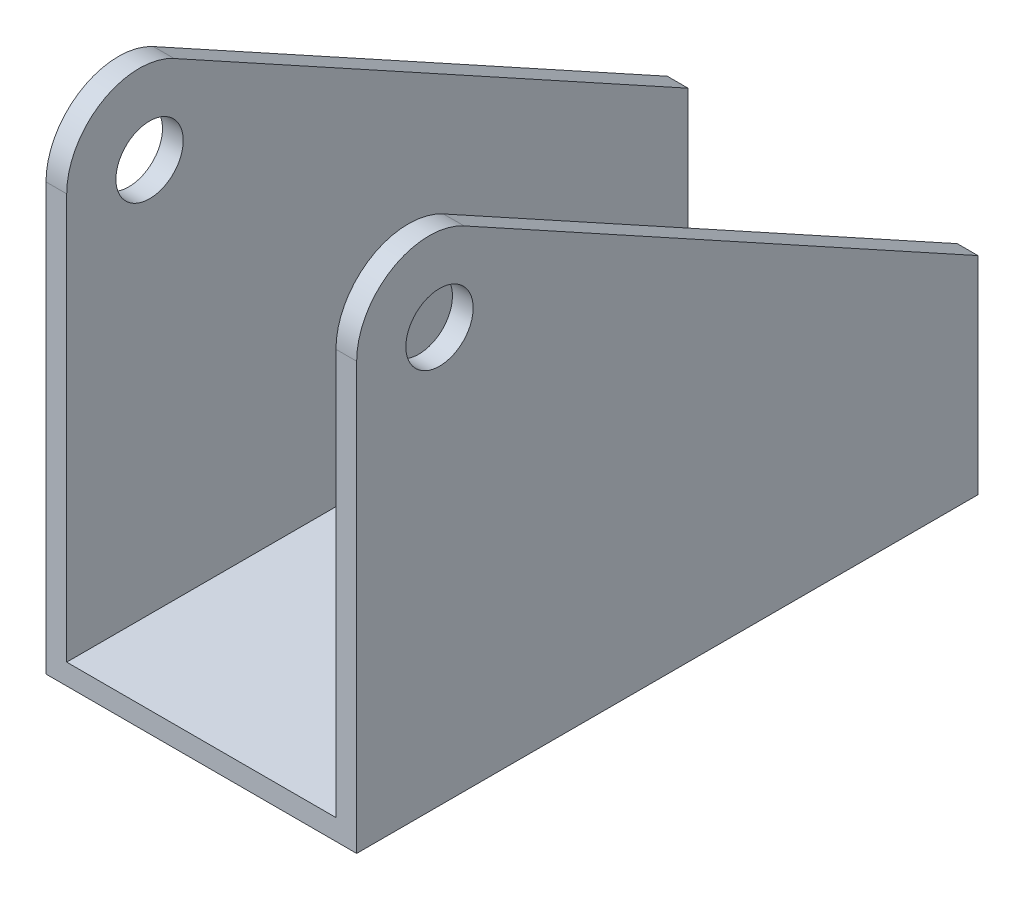
ISO-10303-21;
HEADER;
FILE_DESCRIPTION(('STEP AP214'),'2;1');
FILE_NAME('part.step','',(''),(''),'','','');
FILE_SCHEMA(('AUTOMOTIVE_DESIGN { 1 0 10303 214 1 1 1 1 }'));
ENDSEC;
DATA;
#1=APPLICATION_CONTEXT('core data for automotive mechanical design processes');
#2=APPLICATION_PROTOCOL_DEFINITION('international standard','automotive_design',2000,#1);
#3=PRODUCT_CONTEXT('',#1,'mechanical');
#4=PRODUCT('Part','Part','',(#3));
#5=PRODUCT_RELATED_PRODUCT_CATEGORY('part','',(#4));
#6=PRODUCT_DEFINITION_FORMATION('','',#4);
#7=PRODUCT_DEFINITION_CONTEXT('part definition',#1,'design');
#8=PRODUCT_DEFINITION('design','',#6,#7);
#9=PRODUCT_DEFINITION_SHAPE('','',#8);
#10=(LENGTH_UNIT() NAMED_UNIT(*) SI_UNIT(.MILLI.,.METRE.));
#11=(NAMED_UNIT(*) PLANE_ANGLE_UNIT() SI_UNIT($,.RADIAN.));
#12=(NAMED_UNIT(*) SI_UNIT($,.STERADIAN.) SOLID_ANGLE_UNIT());
#13=UNCERTAINTY_MEASURE_WITH_UNIT(LENGTH_MEASURE(1.E-05),#10,'distance_accuracy_value','');
#14=(GEOMETRIC_REPRESENTATION_CONTEXT(3) GLOBAL_UNCERTAINTY_ASSIGNED_CONTEXT((#13)) GLOBAL_UNIT_ASSIGNED_CONTEXT((#10,
#11,#12)) REPRESENTATION_CONTEXT('',''));
#15=CARTESIAN_POINT('',(0.,0.,0.));
#16=DIRECTION('',(0.,0.,1.));
#17=DIRECTION('',(1.,0.,0.));
#18=AXIS2_PLACEMENT_3D('',#15,#16,#17);
#19=CARTESIAN_POINT('',(-15.,-20.7978366427297,60.));
#20=DIRECTION('',(1.,0.,0.));
#21=DIRECTION('',(0.,1.,0.));
#22=AXIS2_PLACEMENT_3D('',#19,#20,#21);
#23=PLANE('',#22);
#24=CARTESIAN_POINT('',(-15.,-35.7978366427297,52.));
#25=DIRECTION('',(1.,0.,0.));
#26=DIRECTION('',(0.,1.,0.));
#27=AXIS2_PLACEMENT_3D('',#24,#25,#26);
#28=CIRCLE('',#27,3.25);
#29=CARTESIAN_POINT('',(-15.,-32.5478366427297,52.));
#30=VERTEX_POINT('',#29);
#31=EDGE_CURVE('E259',#30,#30,#28,.T.);
#32=ORIENTED_EDGE('',*,*,#31,.T.);
#33=EDGE_LOOP('',(#32));
#34=FACE_BOUND('',#33,.T.);
#35=DIRECTION('',(0.,-1.,0.));
#36=VECTOR('',#35,1.);
#37=CARTESIAN_POINT('',(-15.,-20.7978366427297,60.));
#38=LINE('',#37,#36);
#39=CARTESIAN_POINT('',(-15.,-34.636735190089,60.));
#40=VERTEX_POINT('',#39);
#41=CARTESIAN_POINT('',(-15.,-75.7978366427297,60.));
#42=VERTEX_POINT('',#41);
#43=EDGE_CURVE('E148',#40,#42,#38,.T.);
#44=ORIENTED_EDGE('',*,*,#43,.F.);
#45=CARTESIAN_POINT('',(-15.,-34.636735190089,53.));
#46=DIRECTION('',(1.,0.,0.));
#47=DIRECTION('',(0.,1.,0.));
#48=AXIS2_PLACEMENT_3D('',#45,#46,#47);
#49=CIRCLE('',#48,7.);
#50=CARTESIAN_POINT('',(-15.,-28.5032238293525,49.6265687515949));
#51=VERTEX_POINT('',#50);
#52=EDGE_CURVE('E11',#40,#51,#49,.F.);
#53=ORIENTED_EDGE('',*,*,#52,.T.);
#54=DIRECTION('',(0.,-0.481918749772156,-0.876215908676647));
#55=VECTOR('',#54,1.);
#56=CARTESIAN_POINT('',(-15.,-22.7978366427297,60.));
#57=LINE('',#56,#55);
#58=CARTESIAN_POINT('',(-15.,-55.7978366427297,0.));
#59=VERTEX_POINT('',#58);
#60=EDGE_CURVE('E107',#51,#59,#57,.T.);
#61=ORIENTED_EDGE('',*,*,#60,.T.);
#62=DIRECTION('',(0.,-1.,0.));
#63=VECTOR('',#62,1.);
#64=CARTESIAN_POINT('',(-15.,-20.7978366427297,0.));
#65=LINE('',#64,#63);
#66=CARTESIAN_POINT('',(-15.,-75.7978366427297,0.));
#67=VERTEX_POINT('',#66);
#68=EDGE_CURVE('E111',#59,#67,#65,.T.);
#69=ORIENTED_EDGE('',*,*,#68,.T.);
#70=DIRECTION('',(0.,0.,-1.));
#71=VECTOR('',#70,1.);
#72=CARTESIAN_POINT('',(-15.,-75.7978366427297,60.));
#73=LINE('',#72,#71);
#74=EDGE_CURVE('E158',#42,#67,#73,.T.);
#75=ORIENTED_EDGE('',*,*,#74,.F.);
#76=EDGE_LOOP('',(#44,#53,#61,#69,#75));
#77=FACE_BOUND('',#76,.T.);
#78=ADVANCED_FACE('F34',(#34,#77),#23,.F.);
#79=CARTESIAN_POINT('',(-15.,-75.7978366427297,60.));
#80=DIRECTION('',(0.,1.,0.));
#81=DIRECTION('',(0.,0.,1.));
#82=AXIS2_PLACEMENT_3D('',#79,#80,#81);
#83=PLANE('',#82);
#84=CARTESIAN_POINT('',(0.,-75.7978366427297,12.));
#85=DIRECTION('',(0.,1.,0.));
#86=DIRECTION('',(0.,0.,1.));
#87=AXIS2_PLACEMENT_3D('',#84,#85,#86);
#88=CIRCLE('',#87,3.25);
#89=CARTESIAN_POINT('',(0.,-75.7978366427297,15.25));
#90=VERTEX_POINT('',#89);
#91=EDGE_CURVE('E275',#90,#90,#88,.T.);
#92=ORIENTED_EDGE('',*,*,#91,.T.);
#93=EDGE_LOOP('',(#92));
#94=FACE_BOUND('',#93,.T.);
#95=DIRECTION('',(1.,0.,0.));
#96=VECTOR('',#95,1.);
#97=CARTESIAN_POINT('',(-15.,-75.7978366427297,0.));
#98=LINE('',#97,#96);
#99=CARTESIAN_POINT('',(15.,-75.7978366427297,0.));
#100=VERTEX_POINT('',#99);
#101=EDGE_CURVE('E127',#67,#100,#98,.T.);
#102=ORIENTED_EDGE('',*,*,#101,.T.);
#103=DIRECTION('',(0.,0.,-1.));
#104=VECTOR('',#103,1.);
#105=CARTESIAN_POINT('',(15.,-75.7978366427297,60.));
#106=LINE('',#105,#104);
#107=CARTESIAN_POINT('',(15.,-75.7978366427297,60.));
#108=VERTEX_POINT('',#107);
#109=EDGE_CURVE('E155',#108,#100,#106,.T.);
#110=ORIENTED_EDGE('',*,*,#109,.F.);
#111=DIRECTION('',(1.,0.,0.));
#112=VECTOR('',#111,1.);
#113=CARTESIAN_POINT('',(-15.,-75.7978366427297,60.));
#114=LINE('',#113,#112);
#115=EDGE_CURVE('E267',#42,#108,#114,.T.);
#116=ORIENTED_EDGE('',*,*,#115,.F.);
#117=ORIENTED_EDGE('',*,*,#74,.T.);
#118=EDGE_LOOP('',(#102,#110,#116,#117));
#119=FACE_BOUND('',#118,.T.);
#120=ADVANCED_FACE('F200',(#94,#119),#83,.F.);
#121=CARTESIAN_POINT('',(15.,-20.7978366427297,60.));
#122=DIRECTION('',(-1.,0.,0.));
#123=DIRECTION('',(0.,-1.,0.));
#124=AXIS2_PLACEMENT_3D('',#121,#122,#123);
#125=PLANE('',#124);
#126=CARTESIAN_POINT('',(15.,-35.7978366427297,52.));
#127=DIRECTION('',(1.,0.,0.));
#128=DIRECTION('',(0.,1.,0.));
#129=AXIS2_PLACEMENT_3D('',#126,#127,#128);
#130=CIRCLE('',#129,3.25);
#131=CARTESIAN_POINT('',(15.,-32.5478366427297,52.));
#132=VERTEX_POINT('',#131);
#133=EDGE_CURVE('E243',#132,#132,#130,.T.);
#134=ORIENTED_EDGE('',*,*,#133,.F.);
#135=EDGE_LOOP('',(#134));
#136=FACE_BOUND('',#135,.T.);
#137=DIRECTION('',(0.,-0.481918749772156,-0.876215908676647));
#138=VECTOR('',#137,1.);
#139=CARTESIAN_POINT('',(15.,-22.7978366427297,60.));
#140=LINE('',#139,#138);
#141=CARTESIAN_POINT('',(15.,-28.5032238293525,49.6265687515949));
#142=VERTEX_POINT('',#141);
#143=CARTESIAN_POINT('',(15.,-55.7978366427297,0.));
#144=VERTEX_POINT('',#143);
#145=EDGE_CURVE('E115',#142,#144,#140,.T.);
#146=ORIENTED_EDGE('',*,*,#145,.F.);
#147=CARTESIAN_POINT('',(15.,-34.636735190089,53.));
#148=DIRECTION('',(-1.,0.,0.));
#149=DIRECTION('',(0.,-1.,0.));
#150=AXIS2_PLACEMENT_3D('',#147,#148,#149);
#151=CIRCLE('',#150,7.);
#152=CARTESIAN_POINT('',(15.,-34.636735190089,60.));
#153=VERTEX_POINT('',#152);
#154=EDGE_CURVE('E169',#142,#153,#151,.F.);
#155=ORIENTED_EDGE('',*,*,#154,.T.);
#156=DIRECTION('',(0.,1.,0.));
#157=VECTOR('',#156,1.);
#158=CARTESIAN_POINT('',(15.,-20.7978366427297,60.));
#159=LINE('',#158,#157);
#160=EDGE_CURVE('E251',#108,#153,#159,.T.);
#161=ORIENTED_EDGE('',*,*,#160,.F.);
#162=ORIENTED_EDGE('',*,*,#109,.T.);
#163=DIRECTION('',(0.,1.,0.));
#164=VECTOR('',#163,1.);
#165=CARTESIAN_POINT('',(15.,-20.7978366427297,0.));
#166=LINE('',#165,#164);
#167=EDGE_CURVE('E131',#100,#144,#166,.T.);
#168=ORIENTED_EDGE('',*,*,#167,.T.);
#169=EDGE_LOOP('',(#146,#155,#161,#162,#168));
#170=FACE_BOUND('',#169,.T.);
#171=ADVANCED_FACE('F206',(#136,#170),#125,.F.);
#172=CARTESIAN_POINT('',(13.,-73.7978366427297,60.));
#173=DIRECTION('',(1.,0.,0.));
#174=DIRECTION('',(0.,1.,0.));
#175=AXIS2_PLACEMENT_3D('',#172,#173,#174);
#176=PLANE('',#175);
#177=CARTESIAN_POINT('',(13.,-35.7978366427297,52.));
#178=DIRECTION('',(1.,0.,0.));
#179=DIRECTION('',(0.,1.,0.));
#180=AXIS2_PLACEMENT_3D('',#177,#178,#179);
#181=CIRCLE('',#180,3.25);
#182=CARTESIAN_POINT('',(13.,-32.5478366427297,52.));
#183=VERTEX_POINT('',#182);
#184=EDGE_CURVE('E129',#183,#183,#181,.T.);
#185=ORIENTED_EDGE('',*,*,#184,.T.);
#186=EDGE_LOOP('',(#185));
#187=FACE_BOUND('',#186,.T.);
#188=DIRECTION('',(0.,-1.,0.));
#189=VECTOR('',#188,1.);
#190=CARTESIAN_POINT('',(13.,-73.7978366427297,60.));
#191=LINE('',#190,#189);
#192=CARTESIAN_POINT('',(13.,-34.636735190089,60.));
#193=VERTEX_POINT('',#192);
#194=CARTESIAN_POINT('',(13.,-73.7978366427297,60.));
#195=VERTEX_POINT('',#194);
#196=EDGE_CURVE('E248',#193,#195,#191,.T.);
#197=ORIENTED_EDGE('',*,*,#196,.F.);
#198=CARTESIAN_POINT('',(13.,-34.636735190089,53.));
#199=DIRECTION('',(1.,0.,0.));
#200=DIRECTION('',(0.,1.,0.));
#201=AXIS2_PLACEMENT_3D('',#198,#199,#200);
#202=CIRCLE('',#201,7.);
#203=CARTESIAN_POINT('',(13.,-28.5032238293525,49.6265687515949));
#204=VERTEX_POINT('',#203);
#205=EDGE_CURVE('E175',#193,#204,#202,.F.);
#206=ORIENTED_EDGE('',*,*,#205,.T.);
#207=DIRECTION('',(0.,-0.481918749772156,-0.876215908676647));
#208=VECTOR('',#207,1.);
#209=CARTESIAN_POINT('',(13.,-34.6423663932095,38.4644913627639));
#210=LINE('',#209,#208);
#211=CARTESIAN_POINT('',(13.,-55.7978366427297,0.));
#212=VERTEX_POINT('',#211);
#213=EDGE_CURVE('E166',#204,#212,#210,.T.);
#214=ORIENTED_EDGE('',*,*,#213,.T.);
#215=DIRECTION('',(0.,-1.,0.));
#216=VECTOR('',#215,1.);
#217=CARTESIAN_POINT('',(13.,-73.7978366427297,0.));
#218=LINE('',#217,#216);
#219=CARTESIAN_POINT('',(13.,-73.7978366427297,0.));
#220=VERTEX_POINT('',#219);
#221=EDGE_CURVE('E142',#212,#220,#218,.T.);
#222=ORIENTED_EDGE('',*,*,#221,.T.);
#223=DIRECTION('',(0.,0.,-1.));
#224=VECTOR('',#223,1.);
#225=CARTESIAN_POINT('',(13.,-73.7978366427297,60.));
#226=LINE('',#225,#224);
#227=EDGE_CURVE('E152',#195,#220,#226,.T.);
#228=ORIENTED_EDGE('',*,*,#227,.F.);
#229=EDGE_LOOP('',(#197,#206,#214,#222,#228));
#230=FACE_BOUND('',#229,.T.);
#231=ADVANCED_FACE('F213',(#187,#230),#176,.F.);
#232=CARTESIAN_POINT('',(-13.,-73.7978366427297,60.));
#233=DIRECTION('',(0.,-1.,0.));
#234=DIRECTION('',(0.,0.,-1.));
#235=AXIS2_PLACEMENT_3D('',#232,#233,#234);
#236=PLANE('',#235);
#237=CARTESIAN_POINT('',(0.,-73.7978366427297,12.));
#238=DIRECTION('',(0.,1.,0.));
#239=DIRECTION('',(0.,0.,1.));
#240=AXIS2_PLACEMENT_3D('',#237,#238,#239);
#241=CIRCLE('',#240,3.25);
#242=CARTESIAN_POINT('',(0.,-73.7978366427297,15.25));
#243=VERTEX_POINT('',#242);
#244=EDGE_CURVE('E277',#243,#243,#241,.T.);
#245=ORIENTED_EDGE('',*,*,#244,.F.);
#246=EDGE_LOOP('',(#245));
#247=FACE_BOUND('',#246,.T.);
#248=DIRECTION('',(-1.,0.,0.));
#249=VECTOR('',#248,1.);
#250=CARTESIAN_POINT('',(-13.,-73.7978366427297,0.));
#251=LINE('',#250,#249);
#252=CARTESIAN_POINT('',(-13.,-73.7978366427297,0.));
#253=VERTEX_POINT('',#252);
#254=EDGE_CURVE('E144',#220,#253,#251,.T.);
#255=ORIENTED_EDGE('',*,*,#254,.T.);
#256=DIRECTION('',(0.,0.,-1.));
#257=VECTOR('',#256,1.);
#258=CARTESIAN_POINT('',(-13.,-73.7978366427297,60.));
#259=LINE('',#258,#257);
#260=CARTESIAN_POINT('',(-13.,-73.7978366427297,60.));
#261=VERTEX_POINT('',#260);
#262=EDGE_CURVE('E149',#261,#253,#259,.T.);
#263=ORIENTED_EDGE('',*,*,#262,.F.);
#264=DIRECTION('',(-1.,0.,0.));
#265=VECTOR('',#264,1.);
#266=CARTESIAN_POINT('',(-13.,-73.7978366427297,60.));
#267=LINE('',#266,#265);
#268=EDGE_CURVE('E186',#195,#261,#267,.T.);
#269=ORIENTED_EDGE('',*,*,#268,.F.);
#270=ORIENTED_EDGE('',*,*,#227,.T.);
#271=EDGE_LOOP('',(#255,#263,#269,#270));
#272=FACE_BOUND('',#271,.T.);
#273=ADVANCED_FACE('F217',(#247,#272),#236,.F.);
#274=CARTESIAN_POINT('',(-13.,-20.7978366427297,60.));
#275=DIRECTION('',(-1.,0.,0.));
#276=DIRECTION('',(0.,-1.,0.));
#277=AXIS2_PLACEMENT_3D('',#274,#275,#276);
#278=PLANE('',#277);
#279=CARTESIAN_POINT('',(-13.,-35.7978366427297,52.));
#280=DIRECTION('',(-1.,0.,0.));
#281=DIRECTION('',(0.,-1.,0.));
#282=AXIS2_PLACEMENT_3D('',#279,#280,#281);
#283=CIRCLE('',#282,3.25);
#284=CARTESIAN_POINT('',(-13.,-39.0478366427297,52.));
#285=VERTEX_POINT('',#284);
#286=EDGE_CURVE('E134',#285,#285,#283,.T.);
#287=ORIENTED_EDGE('',*,*,#286,.T.);
#288=EDGE_LOOP('',(#287));
#289=FACE_BOUND('',#288,.T.);
#290=DIRECTION('',(0.,0.481918749772156,0.876215908676647));
#291=VECTOR('',#290,1.);
#292=CARTESIAN_POINT('',(-13.,-22.3333452799658,60.8445297504798));
#293=LINE('',#292,#291);
#294=CARTESIAN_POINT('',(-13.,-55.7978366427297,0.));
#295=VERTEX_POINT('',#294);
#296=CARTESIAN_POINT('',(-13.,-28.5032238293525,49.6265687515949));
#297=VERTEX_POINT('',#296);
#298=EDGE_CURVE('E120',#295,#297,#293,.T.);
#299=ORIENTED_EDGE('',*,*,#298,.T.);
#300=CARTESIAN_POINT('',(-13.,-34.636735190089,53.));
#301=DIRECTION('',(-1.,0.,0.));
#302=DIRECTION('',(0.,-1.,0.));
#303=AXIS2_PLACEMENT_3D('',#300,#301,#302);
#304=CIRCLE('',#303,7.);
#305=CARTESIAN_POINT('',(-13.,-34.636735190089,60.));
#306=VERTEX_POINT('',#305);
#307=EDGE_CURVE('E42',#297,#306,#304,.F.);
#308=ORIENTED_EDGE('',*,*,#307,.T.);
#309=DIRECTION('',(0.,1.,0.));
#310=VECTOR('',#309,1.);
#311=CARTESIAN_POINT('',(-13.,-20.7978366427297,60.));
#312=LINE('',#311,#310);
#313=EDGE_CURVE('E137',#261,#306,#312,.T.);
#314=ORIENTED_EDGE('',*,*,#313,.F.);
#315=ORIENTED_EDGE('',*,*,#262,.T.);
#316=DIRECTION('',(0.,1.,0.));
#317=VECTOR('',#316,1.);
#318=CARTESIAN_POINT('',(-13.,-20.7978366427297,0.));
#319=LINE('',#318,#317);
#320=EDGE_CURVE('E146',#253,#295,#319,.T.);
#321=ORIENTED_EDGE('',*,*,#320,.T.);
#322=EDGE_LOOP('',(#299,#308,#314,#315,#321));
#323=FACE_BOUND('',#322,.T.);
#324=ADVANCED_FACE('F181',(#289,#323),#278,.F.);
#325=CARTESIAN_POINT('',(0.,0.,60.));
#326=DIRECTION('',(0.,0.,1.));
#327=DIRECTION('',(1.,0.,0.));
#328=AXIS2_PLACEMENT_3D('',#325,#326,#327);
#329=PLANE('',#328);
#330=ORIENTED_EDGE('',*,*,#160,.T.);
#331=DIRECTION('',(1.,0.,0.));
#332=VECTOR('',#331,1.);
#333=CARTESIAN_POINT('',(13.,-34.636735190089,60.));
#334=LINE('',#333,#332);
#335=EDGE_CURVE('E173',#153,#193,#334,.F.);
#336=ORIENTED_EDGE('',*,*,#335,.T.);
#337=ORIENTED_EDGE('',*,*,#196,.T.);
#338=ORIENTED_EDGE('',*,*,#268,.T.);
#339=ORIENTED_EDGE('',*,*,#313,.T.);
#340=DIRECTION('',(1.,0.,0.));
#341=VECTOR('',#340,1.);
#342=CARTESIAN_POINT('',(-15.,-34.636735190089,60.));
#343=LINE('',#342,#341);
#344=EDGE_CURVE('E171',#306,#40,#343,.F.);
#345=ORIENTED_EDGE('',*,*,#344,.T.);
#346=ORIENTED_EDGE('',*,*,#43,.T.);
#347=ORIENTED_EDGE('',*,*,#115,.T.);
#348=EDGE_LOOP('',(#330,#336,#337,#338,#339,#345,#346,#347));
#349=FACE_BOUND('',#348,.T.);
#350=ADVANCED_FACE('F184',(#349),#329,.T.);
#351=CARTESIAN_POINT('',(0.,0.,0.));
#352=DIRECTION('',(0.,0.,1.));
#353=DIRECTION('',(1.,0.,0.));
#354=AXIS2_PLACEMENT_3D('',#351,#352,#353);
#355=PLANE('',#354);
#356=ORIENTED_EDGE('',*,*,#68,.F.);
#357=DIRECTION('',(1.,0.,0.));
#358=VECTOR('',#357,1.);
#359=CARTESIAN_POINT('',(-15.,-55.7978366427297,0.));
#360=LINE('',#359,#358);
#361=EDGE_CURVE('E114',#59,#295,#360,.T.);
#362=ORIENTED_EDGE('',*,*,#361,.T.);
#363=ORIENTED_EDGE('',*,*,#320,.F.);
#364=ORIENTED_EDGE('',*,*,#254,.F.);
#365=ORIENTED_EDGE('',*,*,#221,.F.);
#366=DIRECTION('',(1.,0.,0.));
#367=VECTOR('',#366,1.);
#368=CARTESIAN_POINT('',(0.,-55.7978366427297,0.));
#369=LINE('',#368,#367);
#370=EDGE_CURVE('E160',#212,#144,#369,.T.);
#371=ORIENTED_EDGE('',*,*,#370,.T.);
#372=ORIENTED_EDGE('',*,*,#167,.F.);
#373=ORIENTED_EDGE('',*,*,#101,.F.);
#374=EDGE_LOOP('',(#356,#362,#363,#364,#365,#371,#372,#373));
#375=FACE_BOUND('',#374,.T.);
#376=ADVANCED_FACE('F125',(#375),#355,.F.);
#377=CARTESIAN_POINT('',(-15.,-22.7978366427297,60.));
#378=DIRECTION('',(0.,-0.876215908676647,0.481918749772156));
#379=DIRECTION('',(0.,-0.481918749772156,-0.876215908676647));
#380=AXIS2_PLACEMENT_3D('',#377,#378,#379);
#381=PLANE('',#380);
#382=ORIENTED_EDGE('',*,*,#213,.F.);
#383=DIRECTION('',(1.,0.,0.));
#384=VECTOR('',#383,1.);
#385=CARTESIAN_POINT('',(15.,-28.5032238293525,49.6265687515949));
#386=LINE('',#385,#384);
#387=EDGE_CURVE('E163',#204,#142,#386,.T.);
#388=ORIENTED_EDGE('',*,*,#387,.T.);
#389=ORIENTED_EDGE('',*,*,#145,.T.);
#390=ORIENTED_EDGE('',*,*,#370,.F.);
#391=EDGE_LOOP('',(#382,#388,#389,#390));
#392=FACE_BOUND('',#391,.T.);
#393=ADVANCED_FACE('F227',(#392),#381,.F.);
#394=ORIENTED_EDGE('',*,*,#60,.F.);
#395=DIRECTION('',(1.,0.,0.));
#396=VECTOR('',#395,1.);
#397=CARTESIAN_POINT('',(-13.,-28.5032238293525,49.6265687515949));
#398=LINE('',#397,#396);
#399=EDGE_CURVE('E177',#51,#297,#398,.T.);
#400=ORIENTED_EDGE('',*,*,#399,.T.);
#401=ORIENTED_EDGE('',*,*,#298,.F.);
#402=ORIENTED_EDGE('',*,*,#361,.F.);
#403=EDGE_LOOP('',(#394,#400,#401,#402));
#404=FACE_BOUND('',#403,.T.);
#405=ADVANCED_FACE('F118',(#404),#381,.F.);
#406=CARTESIAN_POINT('',(-15.,-35.7978366427297,52.));
#407=DIRECTION('',(1.,0.,0.));
#408=DIRECTION('',(0.,1.,0.));
#409=AXIS2_PLACEMENT_3D('',#406,#407,#408);
#410=CYLINDRICAL_SURFACE('',#409,3.25);
#411=ORIENTED_EDGE('',*,*,#31,.F.);
#412=EDGE_LOOP('',(#411));
#413=FACE_BOUND('',#412,.T.);
#414=ORIENTED_EDGE('',*,*,#286,.F.);
#415=EDGE_LOOP('',(#414));
#416=FACE_BOUND('',#415,.T.);
#417=ADVANCED_FACE('F234',(#413,#416),#410,.F.);
#418=ORIENTED_EDGE('',*,*,#133,.T.);
#419=EDGE_LOOP('',(#418));
#420=FACE_BOUND('',#419,.T.);
#421=ORIENTED_EDGE('',*,*,#184,.F.);
#422=EDGE_LOOP('',(#421));
#423=FACE_BOUND('',#422,.T.);
#424=ADVANCED_FACE('F197',(#420,#423),#410,.F.);
#425=CARTESIAN_POINT('',(-15.,-34.636735190089,53.));
#426=DIRECTION('',(-1.,0.,0.));
#427=DIRECTION('',(0.,-1.,0.));
#428=AXIS2_PLACEMENT_3D('',#425,#426,#427);
#429=CYLINDRICAL_SURFACE('',#428,7.);
#430=ORIENTED_EDGE('',*,*,#205,.F.);
#431=ORIENTED_EDGE('',*,*,#335,.F.);
#432=ORIENTED_EDGE('',*,*,#154,.F.);
#433=ORIENTED_EDGE('',*,*,#387,.F.);
#434=EDGE_LOOP('',(#430,#431,#432,#433));
#435=FACE_BOUND('',#434,.T.);
#436=ADVANCED_FACE('F190',(#435),#429,.T.);
#437=CARTESIAN_POINT('',(-15.,-34.636735190089,53.));
#438=DIRECTION('',(-1.,0.,0.));
#439=DIRECTION('',(0.,-1.,0.));
#440=AXIS2_PLACEMENT_3D('',#437,#438,#439);
#441=CYLINDRICAL_SURFACE('',#440,7.);
#442=ORIENTED_EDGE('',*,*,#52,.F.);
#443=ORIENTED_EDGE('',*,*,#344,.F.);
#444=ORIENTED_EDGE('',*,*,#307,.F.);
#445=ORIENTED_EDGE('',*,*,#399,.F.);
#446=EDGE_LOOP('',(#442,#443,#444,#445));
#447=FACE_BOUND('',#446,.T.);
#448=ADVANCED_FACE('F36',(#447),#441,.T.);
#449=CARTESIAN_POINT('',(0.,-75.7978366427297,12.));
#450=DIRECTION('',(0.,1.,0.));
#451=DIRECTION('',(0.,0.,1.));
#452=AXIS2_PLACEMENT_3D('',#449,#450,#451);
#453=CYLINDRICAL_SURFACE('',#452,3.25);
#454=ORIENTED_EDGE('',*,*,#91,.F.);
#455=EDGE_LOOP('',(#454));
#456=FACE_BOUND('',#455,.T.);
#457=ORIENTED_EDGE('',*,*,#244,.T.);
#458=EDGE_LOOP('',(#457));
#459=FACE_BOUND('',#458,.T.);
#460=ADVANCED_FACE('F189',(#456,#459),#453,.F.);
#461=CLOSED_SHELL('',(#78,#120,#171,#231,#273,#324,#350,#376,#393,#405,#417,#424,#436,#448,#460));
#462=MANIFOLD_SOLID_BREP('B2',#461);
#463=ADVANCED_BREP_SHAPE_REPRESENTATION('',(#18,#462),#14);
#464=SHAPE_DEFINITION_REPRESENTATION(#9,#463);
ENDSEC;
END-ISO-10303-21;
